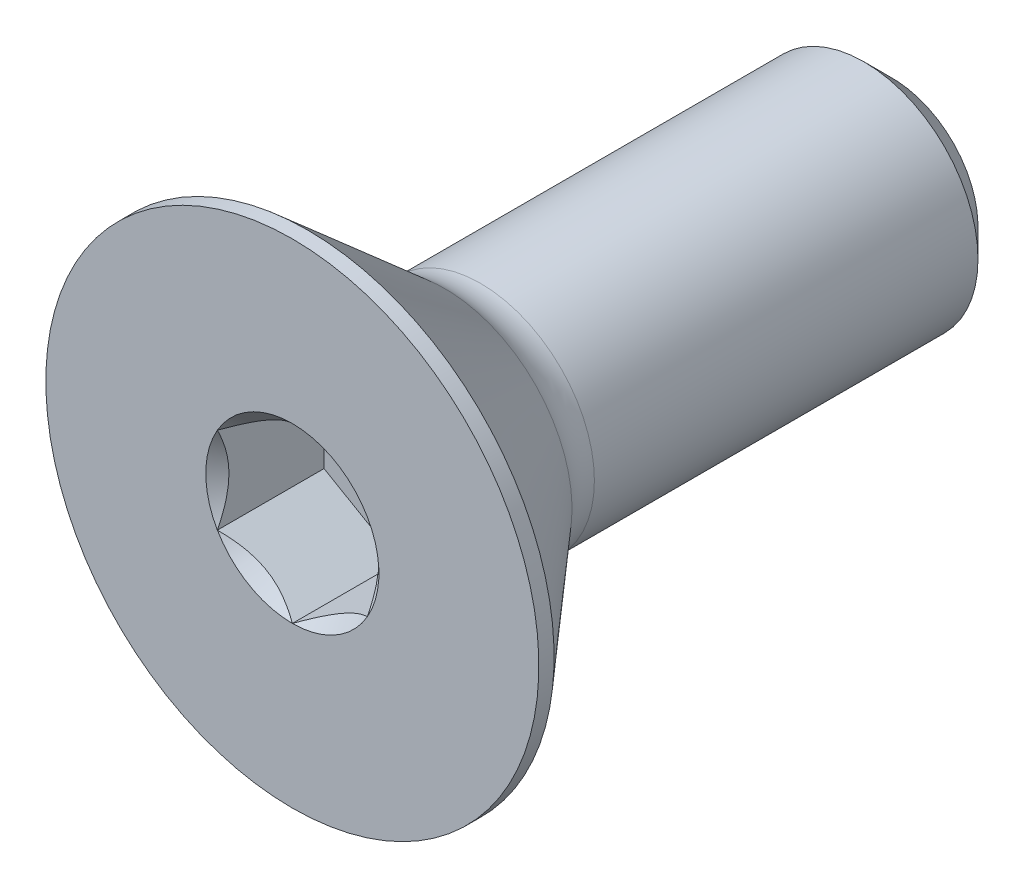
ISO-10303-21;
HEADER;
FILE_DESCRIPTION(('STEP AP214'),'2;1');
FILE_NAME('part.step','',(''),(''),'','','');
FILE_SCHEMA(('AUTOMOTIVE_DESIGN { 1 0 10303 214 1 1 1 1 }'));
ENDSEC;
DATA;
#1=APPLICATION_CONTEXT('core data for automotive mechanical design processes');
#2=APPLICATION_PROTOCOL_DEFINITION('international standard','automotive_design',2000,#1);
#3=PRODUCT_CONTEXT('',#1,'mechanical');
#4=PRODUCT('Part','Part','',(#3));
#5=PRODUCT_RELATED_PRODUCT_CATEGORY('part','',(#4));
#6=PRODUCT_DEFINITION_FORMATION('','',#4);
#7=PRODUCT_DEFINITION_CONTEXT('part definition',#1,'design');
#8=PRODUCT_DEFINITION('design','',#6,#7);
#9=PRODUCT_DEFINITION_SHAPE('','',#8);
#10=(LENGTH_UNIT() NAMED_UNIT(*) SI_UNIT(.MILLI.,.METRE.));
#11=(NAMED_UNIT(*) PLANE_ANGLE_UNIT() SI_UNIT($,.RADIAN.));
#12=(NAMED_UNIT(*) SI_UNIT($,.STERADIAN.) SOLID_ANGLE_UNIT());
#13=UNCERTAINTY_MEASURE_WITH_UNIT(LENGTH_MEASURE(1.E-05),#10,'distance_accuracy_value','');
#14=(GEOMETRIC_REPRESENTATION_CONTEXT(3) GLOBAL_UNCERTAINTY_ASSIGNED_CONTEXT((#13)) GLOBAL_UNIT_ASSIGNED_CONTEXT((#10,
#11,#12)) REPRESENTATION_CONTEXT('',''));
#15=CARTESIAN_POINT('',(0.,0.,0.));
#16=DIRECTION('',(0.,0.,1.));
#17=DIRECTION('',(1.,0.,0.));
#18=AXIS2_PLACEMENT_3D('',#15,#16,#17);
#19=CARTESIAN_POINT('',(0.,0.,0.));
#20=DIRECTION('',(0.,0.,-1.));
#21=DIRECTION('',(0.,1.,0.));
#22=AXIS2_PLACEMENT_3D('',#19,#20,#21);
#23=PLANE('',#22);
#24=CARTESIAN_POINT('',(0.,0.,0.));
#25=DIRECTION('',(0.,0.,1.));
#26=DIRECTION('',(1.,0.,0.));
#27=AXIS2_PLACEMENT_3D('',#24,#25,#26);
#28=CIRCLE('',#27,1.83308710467706);
#29=CARTESIAN_POINT('',(0.,1.83308710467706,0.));
#30=VERTEX_POINT('',#29);
#31=CARTESIAN_POINT('',(-1.5875,0.916543552338532,0.));
#32=VERTEX_POINT('',#31);
#33=EDGE_CURVE('E134',#30,#32,#28,.T.);
#34=ORIENTED_EDGE('',*,*,#33,.F.);
#35=CARTESIAN_POINT('',(1.5875,0.916543552338539,0.));
#36=VERTEX_POINT('',#35);
#37=EDGE_CURVE('E131',#36,#30,#28,.T.);
#38=ORIENTED_EDGE('',*,*,#37,.F.);
#39=CARTESIAN_POINT('',(1.5875,-0.916543552338539,0.));
#40=VERTEX_POINT('',#39);
#41=EDGE_CURVE('E102',#40,#36,#28,.T.);
#42=ORIENTED_EDGE('',*,*,#41,.F.);
#43=CARTESIAN_POINT('',(0.,-1.83308710467706,0.));
#44=VERTEX_POINT('',#43);
#45=EDGE_CURVE('E94',#44,#40,#28,.T.);
#46=ORIENTED_EDGE('',*,*,#45,.F.);
#47=CARTESIAN_POINT('',(-1.5875,-0.916543552338535,0.));
#48=VERTEX_POINT('',#47);
#49=EDGE_CURVE('E55',#48,#44,#28,.T.);
#50=ORIENTED_EDGE('',*,*,#49,.F.);
#51=EDGE_CURVE('E62',#32,#48,#28,.T.);
#52=ORIENTED_EDGE('',*,*,#51,.F.);
#53=EDGE_LOOP('',(#34,#38,#42,#46,#50,#52));
#54=FACE_BOUND('',#53,.T.);
#55=CARTESIAN_POINT('',(0.,0.,0.));
#56=DIRECTION('',(0.,0.,1.));
#57=DIRECTION('',(0.,-1.,0.));
#58=AXIS2_PLACEMENT_3D('',#55,#56,#57);
#59=CIRCLE('',#58,5.21969999999998);
#60=CARTESIAN_POINT('',(0.,-5.21969999999998,0.));
#61=VERTEX_POINT('',#60);
#62=EDGE_CURVE('E176',#61,#61,#59,.T.);
#63=ORIENTED_EDGE('',*,*,#62,.T.);
#64=EDGE_LOOP('',(#63));
#65=FACE_BOUND('',#64,.T.);
#66=ADVANCED_FACE('F37',(#54,#65),#23,.F.);
#67=CARTESIAN_POINT('',(0.,0.,-3.98263592445422));
#68=DIRECTION('',(0.,0.,1.));
#69=DIRECTION('',(0.,-1.,0.));
#70=AXIS2_PLACEMENT_3D('',#67,#68,#69);
#71=TOROIDAL_SURFACE('',#70,3.56660949397922,1.15360949397922);
#72=CARTESIAN_POINT('',(0.,0.,-3.22579999999999));
#73=DIRECTION('',(0.,0.,1.));
#74=DIRECTION('',(0.,-1.,0.));
#75=AXIS2_PLACEMENT_3D('',#72,#73,#74);
#76=CIRCLE('',#75,2.69596935703716);
#77=CARTESIAN_POINT('',(0.,-2.69596935703717,-3.22579999999998));
#78=VERTEX_POINT('',#77);
#79=EDGE_CURVE('E49',#78,#78,#76,.T.);
#80=ORIENTED_EDGE('',*,*,#79,.F.);
#81=EDGE_LOOP('',(#80));
#82=FACE_BOUND('',#81,.T.);
#83=CARTESIAN_POINT('',(0.,0.,-3.98263592445424));
#84=DIRECTION('',(0.,0.,1.));
#85=DIRECTION('',(1.,0.,0.));
#86=AXIS2_PLACEMENT_3D('',#83,#84,#85);
#87=CIRCLE('',#86,2.41299999999999);
#88=CARTESIAN_POINT('',(2.41299999999999,0.,-3.98263592445424));
#89=VERTEX_POINT('',#88);
#90=EDGE_CURVE('E173',#89,#89,#87,.F.);
#91=ORIENTED_EDGE('',*,*,#90,.F.);
#92=EDGE_LOOP('',(#91));
#93=FACE_BOUND('',#92,.T.);
#94=ADVANCED_FACE('F186',(#82,#93),#71,.F.);
#95=CARTESIAN_POINT('',(0.,0.,-3.22579999999999));
#96=DIRECTION('',(0.,0.,1.));
#97=DIRECTION('',(0.,-1.,0.));
#98=AXIS2_PLACEMENT_3D('',#95,#96,#97);
#99=CONICAL_SURFACE('',#98,2.69596935703716,0.715584993317672);
#100=CARTESIAN_POINT('',(0.,0.,-0.322579999999976));
#101=DIRECTION('',(0.,0.,1.));
#102=DIRECTION('',(0.,-1.,0.));
#103=AXIS2_PLACEMENT_3D('',#100,#101,#102);
#104=CIRCLE('',#103,5.21969999999998);
#105=CARTESIAN_POINT('',(0.,-5.21969999999998,-0.322579999999951));
#106=VERTEX_POINT('',#105);
#107=EDGE_CURVE('E179',#106,#106,#104,.T.);
#108=ORIENTED_EDGE('',*,*,#107,.F.);
#109=EDGE_LOOP('',(#108));
#110=FACE_BOUND('',#109,.T.);
#111=ORIENTED_EDGE('',*,*,#79,.T.);
#112=EDGE_LOOP('',(#111));
#113=FACE_BOUND('',#112,.T.);
#114=ADVANCED_FACE('F184',(#110,#113),#99,.T.);
#115=CARTESIAN_POINT('',(0.,0.,0.));
#116=DIRECTION('',(0.,0.,1.));
#117=DIRECTION('',(0.,-1.,0.));
#118=AXIS2_PLACEMENT_3D('',#115,#116,#117);
#119=CYLINDRICAL_SURFACE('',#118,5.21969999999998);
#120=ORIENTED_EDGE('',*,*,#62,.F.);
#121=EDGE_LOOP('',(#120));
#122=FACE_BOUND('',#121,.T.);
#123=ORIENTED_EDGE('',*,*,#107,.T.);
#124=EDGE_LOOP('',(#123));
#125=FACE_BOUND('',#124,.T.);
#126=ADVANCED_FACE('F205',(#122,#125),#119,.T.);
#127=CARTESIAN_POINT('',(0.,-2.413,-12.7));
#128=DIRECTION('',(0.,0.,-1.));
#129=DIRECTION('',(0.,1.,0.));
#130=AXIS2_PLACEMENT_3D('',#127,#128,#129);
#131=PLANE('',#130);
#132=CARTESIAN_POINT('',(0.,0.,-12.7));
#133=DIRECTION('',(0.,0.,-1.));
#134=DIRECTION('',(0.,1.,0.));
#135=AXIS2_PLACEMENT_3D('',#132,#133,#134);
#136=CIRCLE('',#135,1.8176875);
#137=CARTESIAN_POINT('',(0.,-1.8176875,-12.7));
#138=VERTEX_POINT('',#137);
#139=EDGE_CURVE('E167',#138,#138,#136,.T.);
#140=ORIENTED_EDGE('',*,*,#139,.T.);
#141=EDGE_LOOP('',(#140));
#142=FACE_BOUND('',#141,.T.);
#143=ADVANCED_FACE('F195',(#142),#131,.T.);
#144=CARTESIAN_POINT('',(0.,0.,-12.7));
#145=DIRECTION('',(0.,0.,-1.));
#146=DIRECTION('',(0.,1.,0.));
#147=AXIS2_PLACEMENT_3D('',#144,#145,#146);
#148=CYLINDRICAL_SURFACE('',#147,2.41299999999999);
#149=ORIENTED_EDGE('',*,*,#90,.T.);
#150=EDGE_LOOP('',(#149));
#151=FACE_BOUND('',#150,.T.);
#152=CARTESIAN_POINT('',(0.,0.,-12.1046875));
#153=DIRECTION('',(0.,0.,-1.));
#154=DIRECTION('',(0.,1.,0.));
#155=AXIS2_PLACEMENT_3D('',#152,#153,#154);
#156=CIRCLE('',#155,2.41299999999999);
#157=CARTESIAN_POINT('',(0.,-2.413,-12.1046875));
#158=VERTEX_POINT('',#157);
#159=EDGE_CURVE('E170',#158,#158,#156,.F.);
#160=ORIENTED_EDGE('',*,*,#159,.T.);
#161=EDGE_LOOP('',(#160));
#162=FACE_BOUND('',#161,.T.);
#163=ADVANCED_FACE('F191',(#151,#162),#148,.T.);
#164=CARTESIAN_POINT('',(0.,0.,-12.7));
#165=DIRECTION('',(0.,0.,1.));
#166=DIRECTION('',(0.,-1.,0.));
#167=AXIS2_PLACEMENT_3D('',#164,#165,#166);
#168=CONICAL_SURFACE('',#167,1.8176875,0.785398163397446);
#169=CARTESIAN_POINT('',(0.,-2.413,-12.1046875));
#170=CARTESIAN_POINT('',(0.,-2.406798828125,-12.110888671875));
#171=CARTESIAN_POINT('',(0.,-2.40059765625,-12.11708984375));
#172=CARTESIAN_POINT('',(0.,-2.3881953125,-12.1294921875));
#173=CARTESIAN_POINT('',(0.,-2.381994140625,-12.135693359375));
#174=CARTESIAN_POINT('',(0.,-2.369591796875,-12.148095703125));
#175=CARTESIAN_POINT('',(0.,-2.363390625,-12.154296875));
#176=CARTESIAN_POINT('',(0.,-2.35098828125,-12.16669921875));
#177=CARTESIAN_POINT('',(0.,-2.344787109375,-12.172900390625));
#178=CARTESIAN_POINT('',(0.,-2.332384765625,-12.185302734375));
#179=CARTESIAN_POINT('',(0.,-2.32618359375,-12.19150390625));
#180=CARTESIAN_POINT('',(0.,-2.31378125,-12.20390625));
#181=CARTESIAN_POINT('',(0.,-2.307580078125,-12.210107421875));
#182=CARTESIAN_POINT('',(0.,-2.295177734375,-12.222509765625));
#183=CARTESIAN_POINT('',(0.,-2.2889765625,-12.2287109375));
#184=CARTESIAN_POINT('',(0.,-2.27657421875,-12.24111328125));
#185=CARTESIAN_POINT('',(0.,-2.270373046875,-12.247314453125));
#186=CARTESIAN_POINT('',(0.,-2.257970703125,-12.259716796875));
#187=CARTESIAN_POINT('',(0.,-2.25176953125,-12.26591796875));
#188=CARTESIAN_POINT('',(0.,-2.2393671875,-12.2783203125));
#189=CARTESIAN_POINT('',(0.,-2.233166015625,-12.284521484375));
#190=CARTESIAN_POINT('',(0.,-2.220763671875,-12.296923828125));
#191=CARTESIAN_POINT('',(0.,-2.2145625,-12.303125));
#192=CARTESIAN_POINT('',(0.,-2.20216015625,-12.31552734375));
#193=CARTESIAN_POINT('',(0.,-2.195958984375,-12.321728515625));
#194=CARTESIAN_POINT('',(0.,-2.183556640625,-12.334130859375));
#195=CARTESIAN_POINT('',(0.,-2.17735546875,-12.34033203125));
#196=CARTESIAN_POINT('',(0.,-2.164953125,-12.352734375));
#197=CARTESIAN_POINT('',(0.,-2.158751953125,-12.358935546875));
#198=CARTESIAN_POINT('',(0.,-2.146349609375,-12.371337890625));
#199=CARTESIAN_POINT('',(0.,-2.1401484375,-12.3775390625));
#200=CARTESIAN_POINT('',(0.,-2.12774609375,-12.38994140625));
#201=CARTESIAN_POINT('',(0.,-2.121544921875,-12.396142578125));
#202=CARTESIAN_POINT('',(0.,-2.109142578125,-12.408544921875));
#203=CARTESIAN_POINT('',(0.,-2.10294140625,-12.41474609375));
#204=CARTESIAN_POINT('',(0.,-2.0905390625,-12.4271484375));
#205=CARTESIAN_POINT('',(0.,-2.084337890625,-12.433349609375));
#206=CARTESIAN_POINT('',(0.,-2.071935546875,-12.445751953125));
#207=CARTESIAN_POINT('',(0.,-2.065734375,-12.451953125));
#208=CARTESIAN_POINT('',(0.,-2.05333203125,-12.46435546875));
#209=CARTESIAN_POINT('',(0.,-2.047130859375,-12.470556640625));
#210=CARTESIAN_POINT('',(0.,-2.034728515625,-12.482958984375));
#211=CARTESIAN_POINT('',(0.,-2.02852734375,-12.48916015625));
#212=CARTESIAN_POINT('',(0.,-2.016125,-12.5015625));
#213=CARTESIAN_POINT('',(0.,-2.009923828125,-12.507763671875));
#214=CARTESIAN_POINT('',(0.,-1.997521484375,-12.520166015625));
#215=CARTESIAN_POINT('',(0.,-1.9913203125,-12.5263671875));
#216=CARTESIAN_POINT('',(0.,-1.97891796875,-12.53876953125));
#217=CARTESIAN_POINT('',(0.,-1.972716796875,-12.544970703125));
#218=CARTESIAN_POINT('',(0.,-1.960314453125,-12.557373046875));
#219=CARTESIAN_POINT('',(0.,-1.95411328125,-12.56357421875));
#220=CARTESIAN_POINT('',(0.,-1.9417109375,-12.5759765625));
#221=CARTESIAN_POINT('',(0.,-1.935509765625,-12.582177734375));
#222=CARTESIAN_POINT('',(0.,-1.923107421875,-12.594580078125));
#223=CARTESIAN_POINT('',(0.,-1.91690625,-12.60078125));
#224=CARTESIAN_POINT('',(0.,-1.90450390625,-12.61318359375));
#225=CARTESIAN_POINT('',(0.,-1.898302734375,-12.619384765625));
#226=CARTESIAN_POINT('',(0.,-1.885900390625,-12.631787109375));
#227=CARTESIAN_POINT('',(0.,-1.87969921875,-12.63798828125));
#228=CARTESIAN_POINT('',(0.,-1.867296875,-12.650390625));
#229=CARTESIAN_POINT('',(0.,-1.861095703125,-12.656591796875));
#230=CARTESIAN_POINT('',(0.,-1.848693359375,-12.668994140625));
#231=CARTESIAN_POINT('',(0.,-1.8424921875,-12.6751953125));
#232=CARTESIAN_POINT('',(0.,-1.83008984375,-12.68759765625));
#233=CARTESIAN_POINT('',(0.,-1.823888671875,-12.693798828125));
#234=CARTESIAN_POINT('',(0.,-1.8176875,-12.7));
#235=B_SPLINE_CURVE_WITH_KNOTS('',3,(#169,#170,#171,#172,#173,#174,#175,#176,#177,#178,#179,
#180,#181,#182,#183,#184,#185,#186,#187,#188,#189,#190,#191,#192,#193,#194,#195,#196,#197,#198,
#199,#200,#201,#202,#203,#204,#205,#206,#207,#208,#209,#210,#211,#212,#213,#214,#215,#216,#217,
#218,#219,#220,#221,#222,#223,#224,#225,#226,#227,#228,#229,#230,#231,#232,#233,#234),
.UNSPECIFIED.,.F.,.F.,(4,2,2,2,2,2,2,2,2,2,2,2,2,2,2,2,2,2,2,2,2,2,2,2,2,2,2,2,2,2,2,2,4),(0.,
0.0263093441046948,0.0526186882093893,0.0789280323140841,0.105237376418779,0.131546720523473,
0.157856064628168,0.184165408732863,0.210474752837558,0.236784096942252,0.263093441046947,
0.289402785151641,0.315712129256336,0.342021473361031,0.368330817465725,0.39464016157042,
0.420949505675113,0.447258849779808,0.473568193884503,0.499877537989197,0.526186882093892,
0.552496226198587,0.578805570303282,0.605114914407976,0.631424258512671,0.657733602617365,
0.68404294672206,0.710352290826755,0.736661634931449,0.762970979036144,0.789280323140839,
0.815589667245533,0.841899011350228),.UNSPECIFIED.);
#236=EDGE_CURVE('BSEAM194',#158,#138,#235,.T.);
#237=ORIENTED_EDGE('',*,*,#159,.F.);
#238=ORIENTED_EDGE('',*,*,#139,.F.);
#239=ORIENTED_EDGE('',*,*,#236,.T.);
#240=ORIENTED_EDGE('',*,*,#236,.F.);
#241=EDGE_LOOP('',(#237,#239,#238,#240));
#242=FACE_BOUND('',#241,.T.);
#243=ADVANCED_FACE('F194',(#242),#168,.T.);
#244=CARTESIAN_POINT('',(0.,0.,0.));
#245=DIRECTION('',(0.,0.,1.));
#246=DIRECTION('',(1.,0.,0.));
#247=AXIS2_PLACEMENT_3D('',#244,#245,#246);
#248=CONICAL_SURFACE('',#247,1.83308710467706,0.78539816339745);
#249=ORIENTED_EDGE('',*,*,#41,.T.);
#250=CARTESIAN_POINT('',(1.5875,-1.82796193752854,0.587987263254058));
#251=CARTESIAN_POINT('',(1.5875,-1.78345227640908,0.554386652675512));
#252=CARTESIAN_POINT('',(1.5875,-1.73869460884114,0.521115495298161));
#253=CARTESIAN_POINT('',(1.5875,-1.64858256619969,0.455368117833814));
#254=CARTESIAN_POINT('',(1.5875,-1.60322804415398,0.422892099398184));
#255=CARTESIAN_POINT('',(1.5875,-1.46545441997287,0.326397612124503));
#256=CARTESIAN_POINT('',(1.5875,-1.37200191361453,0.263830163583706));
#257=CARTESIAN_POINT('',(1.5875,-1.17603565005265,0.141002804527021));
#258=CARTESIAN_POINT('',(1.5875,-1.0733091548238,0.0810784497350071));
#259=CARTESIAN_POINT('',(1.5875,-0.86272519118089,-0.0285359672812111));
#260=CARTESIAN_POINT('',(1.5875,-0.754886591703733,-0.0782605310029008));
#261=CARTESIAN_POINT('',(1.5875,-0.593019911876896,-0.139093925888789));
#262=CARTESIAN_POINT('',(1.5875,-0.541388282021828,-0.156553547934595));
#263=CARTESIAN_POINT('',(1.5875,-0.436878539726303,-0.187327632130429));
#264=CARTESIAN_POINT('',(1.5875,-0.384000341684463,-0.200641808717063));
#265=CARTESIAN_POINT('',(1.5875,-0.278196924280276,-0.222211694510345));
#266=CARTESIAN_POINT('',(1.5875,-0.225289653887529,-0.230554071995194));
#267=CARTESIAN_POINT('',(1.5875,-0.118909299564332,-0.242017482290295));
#268=CARTESIAN_POINT('',(1.5875,-0.0654363144870835,-0.245139412639672));
#269=CARTESIAN_POINT('',(1.5875,0.0396125416393633,-0.245930358911123));
#270=CARTESIAN_POINT('',(1.5875,0.0911870234776888,-0.243792656992413));
#271=CARTESIAN_POINT('',(1.5875,0.193894008986134,-0.23460863153596));
#272=CARTESIAN_POINT('',(1.5875,0.245026469231598,-0.227561831148945));
#273=CARTESIAN_POINT('',(1.5875,0.347344844708746,-0.208824783339107));
#274=CARTESIAN_POINT('',(1.5875,0.398516068757364,-0.197055516461223));
#275=CARTESIAN_POINT('',(1.5875,0.499740445944845,-0.169499053519034));
#276=CARTESIAN_POINT('',(1.5875,0.54979369225595,-0.153712193650164));
#277=CARTESIAN_POINT('',(1.5875,0.707380773963358,-0.0980702217836921));
#278=CARTESIAN_POINT('',(1.5875,0.812671633972071,-0.0518781375420608));
#279=CARTESIAN_POINT('',(1.5875,1.01830702525799,0.0508243357707495));
#280=CARTESIAN_POINT('',(1.5875,1.11863208590429,0.107371795349446));
#281=CARTESIAN_POINT('',(1.5875,1.31036772781772,0.224034193110363));
#282=CARTESIAN_POINT('',(1.5875,1.40197355431624,0.283832215784366));
#283=CARTESIAN_POINT('',(1.5875,1.53693633902,0.376273802175126));
#284=CARTESIAN_POINT('',(1.5875,1.58134147295665,0.407413627593985));
#285=CARTESIAN_POINT('',(1.5875,1.66954488801524,0.470516819401319));
#286=CARTESIAN_POINT('',(1.5875,1.7133433326628,0.502479956962184));
#287=CARTESIAN_POINT('',(1.5875,1.75688919183915,0.534784488632256));
#288=B_SPLINE_CURVE_WITH_KNOTS('',3,(#250,#251,#252,#253,#254,#255,#256,#257,#258,#259,#260,
#261,#262,#263,#264,#265,#266,#267,#268,#269,#270,#271,#272,#273,#274,#275,#276,#277,#278,#279,
#280,#281,#282,#283,#284,#285,#286,#287),.UNSPECIFIED.,.F.,.F.,(4,2,2,2,2,2,2,2,2,2,2,2,2,2,2,2,
2,2,4),(0.,0.167300856038502,0.334643709948953,0.67188335848746,1.0283722463923,
1.38363464368218,1.5470077555167,1.71039211899209,1.87083807359551,2.03125644026828,
2.18586834465336,2.34049526948591,2.49782525419329,2.65514207772674,2.99906299923216,
3.34424006214767,3.67226428551495,3.83496498281157,3.99762093763059),.UNSPECIFIED.);
#289=EDGE_CURVE('E11',#40,#36,#288,.T.);
#290=ORIENTED_EDGE('',*,*,#289,.F.);
#291=EDGE_LOOP('',(#249,#290));
#292=FACE_BOUND('',#291,.T.);
#293=ADVANCED_FACE('F106',(#292),#248,.F.);
#294=ORIENTED_EDGE('',*,*,#37,.T.);
#295=CARTESIAN_POINT('',(1.5877,0.916428082284696,0.000115480963703929));
#296=CARTESIAN_POINT('',(1.53312479190086,0.947937093371812,-0.0313691916294056));
#297=CARTESIAN_POINT('',(1.47763696320971,0.979973006203397,-0.0610049539864723));
#298=CARTESIAN_POINT('',(1.36449087915364,1.04529792829092,-0.115267739979177));
#299=CARTESIAN_POINT('',(1.30682185887062,1.07859315267522,-0.139864564866825));
#300=CARTESIAN_POINT('',(1.1905349781269,1.14573141457583,-0.18199963572742));
#301=CARTESIAN_POINT('',(1.13194674474407,1.17955734689075,-0.19964380727018));
#302=CARTESIAN_POINT('',(1.01348022674557,1.24795402294715,-0.226828529915033));
#303=CARTESIAN_POINT('',(0.953605562983896,1.28252267618759,-0.236389379304924));
#304=CARTESIAN_POINT('',(0.850418771876558,1.34209759781022,-0.245015586895993));
#305=CARTESIAN_POINT('',(0.807240015952288,1.36702686416637,-0.246292807190425));
#306=CARTESIAN_POINT('',(0.720953038535399,1.41684467380557,-0.244142944185297));
#307=CARTESIAN_POINT('',(0.677844847078612,1.44173319974743,-0.240714211450658));
#308=CARTESIAN_POINT('',(0.592046335002031,1.49126899379091,-0.229349005566658));
#309=CARTESIAN_POINT('',(0.549356408925407,1.51591603410293,-0.221408628198359));
#310=CARTESIAN_POINT('',(0.464693063478359,1.56479643938728,-0.2014515855489));
#311=CARTESIAN_POINT('',(0.422719959755075,1.58902962212064,-0.18943317079131));
#312=CARTESIAN_POINT('',(0.315211458113566,1.65109968448354,-0.153753102752755));
#313=CARTESIAN_POINT('',(0.2503427717089,1.68855163804125,-0.127401427696864));
#314=CARTESIAN_POINT('',(0.154961599380924,1.74361998356043,-0.0829164631482984));
#315=CARTESIAN_POINT('',(0.123530699536156,1.76176662204668,-0.0672871421988688));
#316=CARTESIAN_POINT('',(0.061246985569636,1.79772614107138,-0.0346015121388987));
#317=CARTESIAN_POINT('',(0.0303939039605754,1.8155391760437,-0.0175458843430302));
#318=CARTESIAN_POINT('',(-0.000200000000001441,1.8332025747309,0.000115480963706772));
#319=B_SPLINE_CURVE_WITH_KNOTS('',3,(#295,#296,#297,#298,#299,#300,#301,#302,#303,#304,#305,
#306,#307,#308,#309,#310,#311,#312,#313,#314,#315,#316,#317,#318),.UNSPECIFIED.,.F.,.F.,(4,2,2,
2,2,2,2,2,2,2,2,4),(0.,0.211482650810815,0.424197870807274,0.633533884524813,0.842342653263345,
0.991755553727138,1.14122083674204,1.29081565918877,1.44047473906437,1.6781878086972,
1.79671410024894,1.91518409436631),.UNSPECIFIED.);
#320=EDGE_CURVE('E133',#36,#30,#319,.T.);
#321=ORIENTED_EDGE('',*,*,#320,.F.);
#322=EDGE_LOOP('',(#294,#321));
#323=FACE_BOUND('',#322,.T.);
#324=ADVANCED_FACE('F317',(#323),#248,.F.);
#325=ORIENTED_EDGE('',*,*,#33,.T.);
#326=CARTESIAN_POINT('',(0.000199999999998305,1.8332025747309,0.000115480963706835));
#327=CARTESIAN_POINT('',(-0.0543752080991381,1.80169356364379,-0.031369191629403));
#328=CARTESIAN_POINT('',(-0.109863036790292,1.7696576508122,-0.0610049539864699));
#329=CARTESIAN_POINT('',(-0.223009120846361,1.70433272872468,-0.115267739979174));
#330=CARTESIAN_POINT('',(-0.280678141129383,1.67103750434037,-0.139864564866823));
#331=CARTESIAN_POINT('',(-0.396965021873105,1.60389924243976,-0.181999635727418));
#332=CARTESIAN_POINT('',(-0.455553255255933,1.57007331012484,-0.199643807270178));
#333=CARTESIAN_POINT('',(-0.574019773254432,1.50167663406845,-0.226828529915031));
#334=CARTESIAN_POINT('',(-0.633894437016106,1.46710798082801,-0.236389379304923));
#335=CARTESIAN_POINT('',(-0.737081228123444,1.40753305920537,-0.245015586895992));
#336=CARTESIAN_POINT('',(-0.780259984047714,1.38260379284922,-0.246292807190423));
#337=CARTESIAN_POINT('',(-0.866546961464603,1.33278598321002,-0.244142944185295));
#338=CARTESIAN_POINT('',(-0.90965515292139,1.30789745726817,-0.240714211450656));
#339=CARTESIAN_POINT('',(-0.995453664997971,1.25836166322469,-0.229349005566656));
#340=CARTESIAN_POINT('',(-1.0381435910746,1.23371462291266,-0.221408628198358));
#341=CARTESIAN_POINT('',(-1.12280693652164,1.18483421762831,-0.201451585548898));
#342=CARTESIAN_POINT('',(-1.16478004024493,1.16060103489495,-0.189433170791309));
#343=CARTESIAN_POINT('',(-1.27228854188644,1.09853097253205,-0.153753102752754));
#344=CARTESIAN_POINT('',(-1.3371572282911,1.06107901897434,-0.127401427696863));
#345=CARTESIAN_POINT('',(-1.43253840061908,1.00601067345516,-0.0829164631482982));
#346=CARTESIAN_POINT('',(-1.46396930046384,0.987864034968916,-0.0672871421988688));
#347=CARTESIAN_POINT('',(-1.52625301443036,0.951904515944216,-0.034601512138899));
#348=CARTESIAN_POINT('',(-1.55710609603942,0.934091480971895,-0.0175458843430306));
#349=CARTESIAN_POINT('',(-1.5877,0.916428082284695,0.000115480963706112));
#350=B_SPLINE_CURVE_WITH_KNOTS('',3,(#326,#327,#328,#329,#330,#331,#332,#333,#334,#335,#336,
#337,#338,#339,#340,#341,#342,#343,#344,#345,#346,#347,#348,#349),.UNSPECIFIED.,.F.,.F.,(4,2,2,
2,2,2,2,2,2,2,2,4),(0.,0.211482650810817,0.424197870807276,0.633533884524815,0.842342653263348,
0.991755553727141,1.14122083674205,1.29081565918877,1.44047473906438,1.6781878086972,
1.79671410024894,1.91518409436631),.UNSPECIFIED.);
#351=EDGE_CURVE('E137',#30,#32,#350,.T.);
#352=ORIENTED_EDGE('',*,*,#351,.F.);
#353=EDGE_LOOP('',(#325,#352));
#354=FACE_BOUND('',#353,.T.);
#355=ADVANCED_FACE('F140',(#354),#248,.F.);
#356=ORIENTED_EDGE('',*,*,#51,.T.);
#357=CARTESIAN_POINT('',(-1.5875,-1.82796193726258,0.587987263053252));
#358=CARTESIAN_POINT('',(-1.5875,-1.78345227615058,0.55438665248244));
#359=CARTESIAN_POINT('',(-1.5875,-1.73869460859013,0.521115495112811));
#360=CARTESIAN_POINT('',(-1.5875,-1.64858256596372,0.455368117663864));
#361=CARTESIAN_POINT('',(-1.5875,-1.60322804392557,0.422892099235912));
#362=CARTESIAN_POINT('',(-1.5875,-1.46545441976761,0.32639761198541));
#363=CARTESIAN_POINT('',(-1.5875,-1.372001913425,0.263830163459999));
#364=CARTESIAN_POINT('',(-1.5875,-1.17603564989744,0.141002804434965));
#365=CARTESIAN_POINT('',(-1.5875,-1.07330915468727,0.081078449659098));
#366=CARTESIAN_POINT('',(-1.5875,-0.862725191083299,-0.0285359673271858));
#367=CARTESIAN_POINT('',(-1.5875,-0.754886591626393,-0.0782605310350682));
#368=CARTESIAN_POINT('',(-1.5875,-0.593019911814793,-0.139093925910707));
#369=CARTESIAN_POINT('',(-1.5875,-0.541388281953344,-0.156553547956913));
#370=CARTESIAN_POINT('',(-1.5875,-0.43687853964485,-0.187327632152255));
#371=CARTESIAN_POINT('',(-1.5875,-0.38400034159642,-0.200641808737998));
#372=CARTESIAN_POINT('',(-1.5875,-0.278196924179272,-0.222211694528003));
#373=CARTESIAN_POINT('',(-1.5875,-0.225289653780157,-0.230554072010506));
#374=CARTESIAN_POINT('',(-1.5875,-0.118909299444435,-0.242017482299473));
#375=CARTESIAN_POINT('',(-1.5875,-0.0654363143610312,-0.245139412645064));
#376=CARTESIAN_POINT('',(-1.5875,0.0396125417767732,-0.245930358907869));
#377=CARTESIAN_POINT('',(-1.5875,0.0911870236203165,-0.243792656984372));
#378=CARTESIAN_POINT('',(-1.5875,0.193894009138675,-0.234608631517599));
#379=CARTESIAN_POINT('',(-1.5875,0.245026469388835,-0.227561831125052));
#380=CARTESIAN_POINT('',(-1.5875,0.347344844875253,-0.208824783303617));
#381=CARTESIAN_POINT('',(-1.5875,0.398516068928431,-0.197055516419635));
#382=CARTESIAN_POINT('',(-1.5875,0.499740446124592,-0.169499053465115));
#383=CARTESIAN_POINT('',(-1.5875,0.549793692439817,-0.153712193590012));
#384=CARTESIAN_POINT('',(-1.5875,0.707380774187261,-0.0980702216941584));
#385=CARTESIAN_POINT('',(-1.5875,0.812671634229885,-0.0518781374254943));
#386=CARTESIAN_POINT('',(-1.5875,1.01830702558102,0.0508243359443597));
#387=CARTESIAN_POINT('',(-1.5875,1.11863208625861,0.107371795553088));
#388=CARTESIAN_POINT('',(-1.5875,1.3103677282283,0.224034193371489));
#389=CARTESIAN_POINT('',(-1.5875,1.40197355475198,0.28383221607268));
#390=CARTESIAN_POINT('',(-1.5875,1.53693633949296,0.37627380250408));
#391=CARTESIAN_POINT('',(-1.5875,1.58134147344183,0.407413627936378));
#392=CARTESIAN_POINT('',(-1.5875,1.66954488852479,0.470516819770574));
#393=CARTESIAN_POINT('',(-1.5875,1.7133433331845,0.502479957344862));
#394=CARTESIAN_POINT('',(-1.5875,1.75688919237298,0.53478448902834));
#395=B_SPLINE_CURVE_WITH_KNOTS('',3,(#357,#358,#359,#360,#361,#362,#363,#364,#365,#366,#367,
#368,#369,#370,#371,#372,#373,#374,#375,#376,#377,#378,#379,#380,#381,#382,#383,#384,#385,#386,
#387,#388,#389,#390,#391,#392,#393,#394),.UNSPECIFIED.,.F.,.F.,(4,2,2,2,2,2,2,2,2,2,2,2,2,2,2,2,
2,2,4),(0.,0.167300856006657,0.334643709885255,0.671883358358864,1.02837224619093,
1.38363464340872,1.54700775526169,1.7103921187555,1.87083807337658,2.03125644006703,
2.18586834446827,2.34049526931701,2.49782525404181,2.65514207759267,2.99906299922329,
3.34424006226481,3.67226428573992,3.83496498308972,3.99762093796191),.UNSPECIFIED.);
#396=EDGE_CURVE('E143',#32,#48,#395,.F.);
#397=ORIENTED_EDGE('',*,*,#396,.F.);
#398=EDGE_LOOP('',(#356,#397));
#399=FACE_BOUND('',#398,.T.);
#400=ADVANCED_FACE('F144',(#399),#248,.F.);
#401=ORIENTED_EDGE('',*,*,#49,.T.);
#402=CARTESIAN_POINT('',(-1.5877,-0.916428082284692,0.000115480963704363));
#403=CARTESIAN_POINT('',(-1.53312479190086,-0.947937093371809,-0.0313691916294055));
#404=CARTESIAN_POINT('',(-1.47763696320971,-0.979973006203394,-0.0610049539864725));
#405=CARTESIAN_POINT('',(-1.36449087915364,-1.04529792829092,-0.115267739979177));
#406=CARTESIAN_POINT('',(-1.30682185887062,-1.07859315267522,-0.139864564866826));
#407=CARTESIAN_POINT('',(-1.1905349781269,-1.14573141457583,-0.181999635727421));
#408=CARTESIAN_POINT('',(-1.13194674474407,-1.17955734689075,-0.199643807270181));
#409=CARTESIAN_POINT('',(-1.01348022674557,-1.24795402294714,-0.226828529915034));
#410=CARTESIAN_POINT('',(-0.953605562983895,-1.28252267618758,-0.236389379304926));
#411=CARTESIAN_POINT('',(-0.850418771876557,-1.34209759781022,-0.245015586895995));
#412=CARTESIAN_POINT('',(-0.807240015952288,-1.36702686416637,-0.246292807190426));
#413=CARTESIAN_POINT('',(-0.720953038535398,-1.41684467380557,-0.244142944185298));
#414=CARTESIAN_POINT('',(-0.677844847078612,-1.44173319974742,-0.240714211450659));
#415=CARTESIAN_POINT('',(-0.592046335002031,-1.49126899379091,-0.229349005566659));
#416=CARTESIAN_POINT('',(-0.549356408925406,-1.51591603410293,-0.221408628198361));
#417=CARTESIAN_POINT('',(-0.464693063478358,-1.56479643938728,-0.201451585548901));
#418=CARTESIAN_POINT('',(-0.422719959755074,-1.58902962212064,-0.189433170791312));
#419=CARTESIAN_POINT('',(-0.315211458113566,-1.65109968448354,-0.153753102752757));
#420=CARTESIAN_POINT('',(-0.2503427717089,-1.68855163804125,-0.127401427696866));
#421=CARTESIAN_POINT('',(-0.154961599380925,-1.74361998356043,-0.082916463148301));
#422=CARTESIAN_POINT('',(-0.123530699536157,-1.76176662204668,-0.0672871421988716));
#423=CARTESIAN_POINT('',(-0.0612469855696377,-1.79772614107138,-0.0346015121389019));
#424=CARTESIAN_POINT('',(-0.0303939039605773,-1.8155391760437,-0.0175458843430335));
#425=CARTESIAN_POINT('',(0.00019999999999925,-1.8332025747309,0.0001154809637034));
#426=B_SPLINE_CURVE_WITH_KNOTS('',3,(#402,#403,#404,#405,#406,#407,#408,#409,#410,#411,#412,
#413,#414,#415,#416,#417,#418,#419,#420,#421,#422,#423,#424,#425),.UNSPECIFIED.,.F.,.F.,(4,2,2,
2,2,2,2,2,2,2,2,4),(0.,0.211482650810817,0.424197870807277,0.633533884524816,0.842342653263349,
0.991755553727142,1.14122083674205,1.29081565918877,1.44047473906438,1.6781878086972,
1.79671410024894,1.91518409436631),.UNSPECIFIED.);
#427=EDGE_CURVE('E118',#48,#44,#426,.T.);
#428=ORIENTED_EDGE('',*,*,#427,.F.);
#429=EDGE_LOOP('',(#401,#428));
#430=FACE_BOUND('',#429,.T.);
#431=ADVANCED_FACE('F336',(#430),#248,.F.);
#432=ORIENTED_EDGE('',*,*,#45,.T.);
#433=CARTESIAN_POINT('',(-0.000200000000000621,-1.8332025747309,0.000115480963703582));
#434=CARTESIAN_POINT('',(0.0543752080991357,-1.80169356364378,-0.0313691916294061));
#435=CARTESIAN_POINT('',(0.109863036790289,-1.7696576508122,-0.0610049539864731));
#436=CARTESIAN_POINT('',(0.223009120846358,-1.70433272872467,-0.115267739979178));
#437=CARTESIAN_POINT('',(0.28067814112938,-1.67103750434037,-0.139864564866827));
#438=CARTESIAN_POINT('',(0.396965021873102,-1.60389924243976,-0.181999635727421));
#439=CARTESIAN_POINT('',(0.45555325525593,-1.57007331012484,-0.199643807270181));
#440=CARTESIAN_POINT('',(0.574019773254429,-1.50167663406845,-0.226828529915034));
#441=CARTESIAN_POINT('',(0.633894437016103,-1.46710798082801,-0.236389379304926));
#442=CARTESIAN_POINT('',(0.737081228123441,-1.40753305920537,-0.245015586895995));
#443=CARTESIAN_POINT('',(0.78025998404771,-1.38260379284922,-0.246292807190427));
#444=CARTESIAN_POINT('',(0.866546961464599,-1.33278598321002,-0.244142944185299));
#445=CARTESIAN_POINT('',(0.909655152921386,-1.30789745726817,-0.24071421145066));
#446=CARTESIAN_POINT('',(0.995453664997967,-1.25836166322469,-0.22934900556666));
#447=CARTESIAN_POINT('',(1.03814359107459,-1.23371462291266,-0.221408628198362));
#448=CARTESIAN_POINT('',(1.12280693652164,-1.18483421762831,-0.201451585548902));
#449=CARTESIAN_POINT('',(1.16478004024492,-1.16060103489495,-0.189433170791313));
#450=CARTESIAN_POINT('',(1.27228854188643,-1.09853097253205,-0.153753102752758));
#451=CARTESIAN_POINT('',(1.3371572282911,-1.06107901897434,-0.127401427696867));
#452=CARTESIAN_POINT('',(1.43253840061907,-1.00601067345516,-0.0829164631483016));
#453=CARTESIAN_POINT('',(1.46396930046384,-0.987864034968915,-0.0672871421988721));
#454=CARTESIAN_POINT('',(1.52625301443036,-0.951904515944215,-0.0346015121389021));
#455=CARTESIAN_POINT('',(1.55710609603942,-0.934091480971894,-0.0175458843430337));
#456=CARTESIAN_POINT('',(1.5877,-0.916428082284694,0.000115480963703085));
#457=B_SPLINE_CURVE_WITH_KNOTS('',3,(#433,#434,#435,#436,#437,#438,#439,#440,#441,#442,#443,
#444,#445,#446,#447,#448,#449,#450,#451,#452,#453,#454,#455,#456),.UNSPECIFIED.,.F.,.F.,(4,2,2,
2,2,2,2,2,2,2,2,4),(0.,0.211482650810816,0.424197870807275,0.633533884524815,0.842342653263347,
0.991755553727139,1.14122083674204,1.29081565918877,1.44047473906437,1.6781878086972,
1.79671410024894,1.91518409436631),.UNSPECIFIED.);
#458=EDGE_CURVE('E98',#44,#40,#457,.T.);
#459=ORIENTED_EDGE('',*,*,#458,.F.);
#460=EDGE_LOOP('',(#432,#459));
#461=FACE_BOUND('',#460,.T.);
#462=ADVANCED_FACE('F96',(#461),#248,.F.);
#463=CARTESIAN_POINT('',(1.5875,-0.916543552338531,-2.25806));
#464=DIRECTION('',(0.,0.,1.));
#465=DIRECTION('',(1.,0.,0.));
#466=AXIS2_PLACEMENT_3D('',#463,#464,#465);
#467=PLANE('',#466);
#468=DIRECTION('',(0.866025403784439,0.5,0.));
#469=VECTOR('',#468,1.);
#470=CARTESIAN_POINT('',(0.,-1.83308710467706,-2.25806));
#471=LINE('',#470,#469);
#472=CARTESIAN_POINT('',(0.,-1.83308710467706,-2.25806));
#473=VERTEX_POINT('',#472);
#474=CARTESIAN_POINT('',(1.5875,-0.916543552338531,-2.25806));
#475=VERTEX_POINT('',#474);
#476=EDGE_CURVE('E117',#473,#475,#471,.T.);
#477=ORIENTED_EDGE('',*,*,#476,.T.);
#478=DIRECTION('',(0.,1.,0.));
#479=VECTOR('',#478,1.);
#480=CARTESIAN_POINT('',(1.5875,-0.916543552338531,-2.25806));
#481=LINE('',#480,#479);
#482=CARTESIAN_POINT('',(1.5875,0.916543552338534,-2.25806));
#483=VERTEX_POINT('',#482);
#484=EDGE_CURVE('E122',#475,#483,#481,.T.);
#485=ORIENTED_EDGE('',*,*,#484,.T.);
#486=DIRECTION('',(-0.866025403784439,0.5,0.));
#487=VECTOR('',#486,1.);
#488=CARTESIAN_POINT('',(1.5875,0.916543552338534,-2.25806));
#489=LINE('',#488,#487);
#490=CARTESIAN_POINT('',(0.,1.83308710467706,-2.25806));
#491=VERTEX_POINT('',#490);
#492=EDGE_CURVE('E394',#483,#491,#489,.T.);
#493=ORIENTED_EDGE('',*,*,#492,.T.);
#494=DIRECTION('',(-0.866025403784438,-0.5,0.));
#495=VECTOR('',#494,1.);
#496=CARTESIAN_POINT('',(0.,1.83308710467706,-2.25806));
#497=LINE('',#496,#495);
#498=CARTESIAN_POINT('',(-1.5875,0.916543552338533,-2.25806));
#499=VERTEX_POINT('',#498);
#500=EDGE_CURVE('E397',#491,#499,#497,.T.);
#501=ORIENTED_EDGE('',*,*,#500,.T.);
#502=DIRECTION('',(0.,-1.,0.));
#503=VECTOR('',#502,1.);
#504=CARTESIAN_POINT('',(-1.5875,0.916543552338533,-2.25806));
#505=LINE('',#504,#503);
#506=CARTESIAN_POINT('',(-1.5875,-0.91654355233853,-2.25806));
#507=VERTEX_POINT('',#506);
#508=EDGE_CURVE('E158',#499,#507,#505,.T.);
#509=ORIENTED_EDGE('',*,*,#508,.T.);
#510=DIRECTION('',(0.866025403784439,-0.5,0.));
#511=VECTOR('',#510,1.);
#512=CARTESIAN_POINT('',(-1.5875,-0.91654355233853,-2.25806));
#513=LINE('',#512,#511);
#514=EDGE_CURVE('E125',#507,#473,#513,.T.);
#515=ORIENTED_EDGE('',*,*,#514,.T.);
#516=EDGE_LOOP('',(#477,#485,#493,#501,#509,#515));
#517=FACE_BOUND('',#516,.T.);
#518=ADVANCED_FACE('F303',(#517),#467,.T.);
#519=CARTESIAN_POINT('',(1.5875,-0.916543552338531,-2.25806));
#520=DIRECTION('',(1.,0.,0.));
#521=DIRECTION('',(0.,1.,0.));
#522=AXIS2_PLACEMENT_3D('',#519,#520,#521);
#523=PLANE('',#522);
#524=DIRECTION('',(0.,0.,1.));
#525=VECTOR('',#524,1.);
#526=CARTESIAN_POINT('',(1.5875,-0.916543552338531,-2.25806));
#527=LINE('',#526,#525);
#528=EDGE_CURVE('E114',#475,#40,#527,.T.);
#529=ORIENTED_EDGE('',*,*,#528,.T.);
#530=ORIENTED_EDGE('',*,*,#289,.T.);
#531=DIRECTION('',(0.,0.,1.));
#532=VECTOR('',#531,1.);
#533=CARTESIAN_POINT('',(1.5875,0.916543552338534,-2.25806));
#534=LINE('',#533,#532);
#535=EDGE_CURVE('E124',#483,#36,#534,.T.);
#536=ORIENTED_EDGE('',*,*,#535,.F.);
#537=ORIENTED_EDGE('',*,*,#484,.F.);
#538=EDGE_LOOP('',(#529,#530,#536,#537));
#539=FACE_BOUND('',#538,.T.);
#540=ADVANCED_FACE('F120',(#539),#523,.F.);
#541=CARTESIAN_POINT('',(1.5875,0.916543552338534,-2.25806));
#542=DIRECTION('',(0.5,0.866025403784439,0.));
#543=DIRECTION('',(-0.866025403784439,0.5,0.));
#544=AXIS2_PLACEMENT_3D('',#541,#542,#543);
#545=PLANE('',#544);
#546=ORIENTED_EDGE('',*,*,#535,.T.);
#547=ORIENTED_EDGE('',*,*,#320,.T.);
#548=DIRECTION('',(0.,0.,1.));
#549=VECTOR('',#548,1.);
#550=CARTESIAN_POINT('',(0.,1.83308710467706,-2.25806));
#551=LINE('',#550,#549);
#552=EDGE_CURVE('E154',#491,#30,#551,.T.);
#553=ORIENTED_EDGE('',*,*,#552,.F.);
#554=ORIENTED_EDGE('',*,*,#492,.F.);
#555=EDGE_LOOP('',(#546,#547,#553,#554));
#556=FACE_BOUND('',#555,.T.);
#557=ADVANCED_FACE('F287',(#556),#545,.F.);
#558=CARTESIAN_POINT('',(0.,1.83308710467706,-2.25806));
#559=DIRECTION('',(-0.5,0.866025403784438,0.));
#560=DIRECTION('',(-0.866025403784438,-0.5,0.));
#561=AXIS2_PLACEMENT_3D('',#558,#559,#560);
#562=PLANE('',#561);
#563=ORIENTED_EDGE('',*,*,#552,.T.);
#564=ORIENTED_EDGE('',*,*,#351,.T.);
#565=DIRECTION('',(0.,0.,1.));
#566=VECTOR('',#565,1.);
#567=CARTESIAN_POINT('',(-1.5875,0.916543552338533,-2.25806));
#568=LINE('',#567,#566);
#569=EDGE_CURVE('E152',#499,#32,#568,.T.);
#570=ORIENTED_EDGE('',*,*,#569,.F.);
#571=ORIENTED_EDGE('',*,*,#500,.F.);
#572=EDGE_LOOP('',(#563,#564,#570,#571));
#573=FACE_BOUND('',#572,.T.);
#574=ADVANCED_FACE('F150',(#573),#562,.F.);
#575=CARTESIAN_POINT('',(-1.5875,0.916543552338533,-2.25806));
#576=DIRECTION('',(-1.,0.,0.));
#577=DIRECTION('',(0.,-1.,0.));
#578=AXIS2_PLACEMENT_3D('',#575,#576,#577);
#579=PLANE('',#578);
#580=ORIENTED_EDGE('',*,*,#569,.T.);
#581=ORIENTED_EDGE('',*,*,#396,.T.);
#582=DIRECTION('',(0.,0.,1.));
#583=VECTOR('',#582,1.);
#584=CARTESIAN_POINT('',(-1.5875,-0.91654355233853,-2.25806));
#585=LINE('',#584,#583);
#586=EDGE_CURVE('E160',#507,#48,#585,.T.);
#587=ORIENTED_EDGE('',*,*,#586,.F.);
#588=ORIENTED_EDGE('',*,*,#508,.F.);
#589=EDGE_LOOP('',(#580,#581,#587,#588));
#590=FACE_BOUND('',#589,.T.);
#591=ADVANCED_FACE('F156',(#590),#579,.F.);
#592=CARTESIAN_POINT('',(-1.5875,-0.91654355233853,-2.25806));
#593=DIRECTION('',(-0.5,-0.866025403784439,0.));
#594=DIRECTION('',(0.866025403784439,-0.5,0.));
#595=AXIS2_PLACEMENT_3D('',#592,#593,#594);
#596=PLANE('',#595);
#597=ORIENTED_EDGE('',*,*,#586,.T.);
#598=ORIENTED_EDGE('',*,*,#427,.T.);
#599=DIRECTION('',(0.,0.,1.));
#600=VECTOR('',#599,1.);
#601=CARTESIAN_POINT('',(0.,-1.83308710467706,-2.25806));
#602=LINE('',#601,#600);
#603=EDGE_CURVE('E116',#473,#44,#602,.T.);
#604=ORIENTED_EDGE('',*,*,#603,.F.);
#605=ORIENTED_EDGE('',*,*,#514,.F.);
#606=EDGE_LOOP('',(#597,#598,#604,#605));
#607=FACE_BOUND('',#606,.T.);
#608=ADVANCED_FACE('F264',(#607),#596,.F.);
#609=CARTESIAN_POINT('',(0.,-1.83308710467706,-2.25806));
#610=DIRECTION('',(0.5,-0.866025403784439,0.));
#611=DIRECTION('',(0.866025403784439,0.5,0.));
#612=AXIS2_PLACEMENT_3D('',#609,#610,#611);
#613=PLANE('',#612);
#614=ORIENTED_EDGE('',*,*,#603,.T.);
#615=ORIENTED_EDGE('',*,*,#458,.T.);
#616=ORIENTED_EDGE('',*,*,#528,.F.);
#617=ORIENTED_EDGE('',*,*,#476,.F.);
#618=EDGE_LOOP('',(#614,#615,#616,#617));
#619=FACE_BOUND('',#618,.T.);
#620=ADVANCED_FACE('F112',(#619),#613,.F.);
#621=CLOSED_SHELL('',(#66,#94,#114,#126,#143,#163,#243,#293,#324,#355,#400,#431,#462,#518,#540,
#557,#574,#591,#608,#620));
#622=MANIFOLD_SOLID_BREP('B2',#621);
#623=ADVANCED_BREP_SHAPE_REPRESENTATION('',(#18,#622),#14);
#624=SHAPE_DEFINITION_REPRESENTATION(#9,#623);
ENDSEC;
END-ISO-10303-21;
